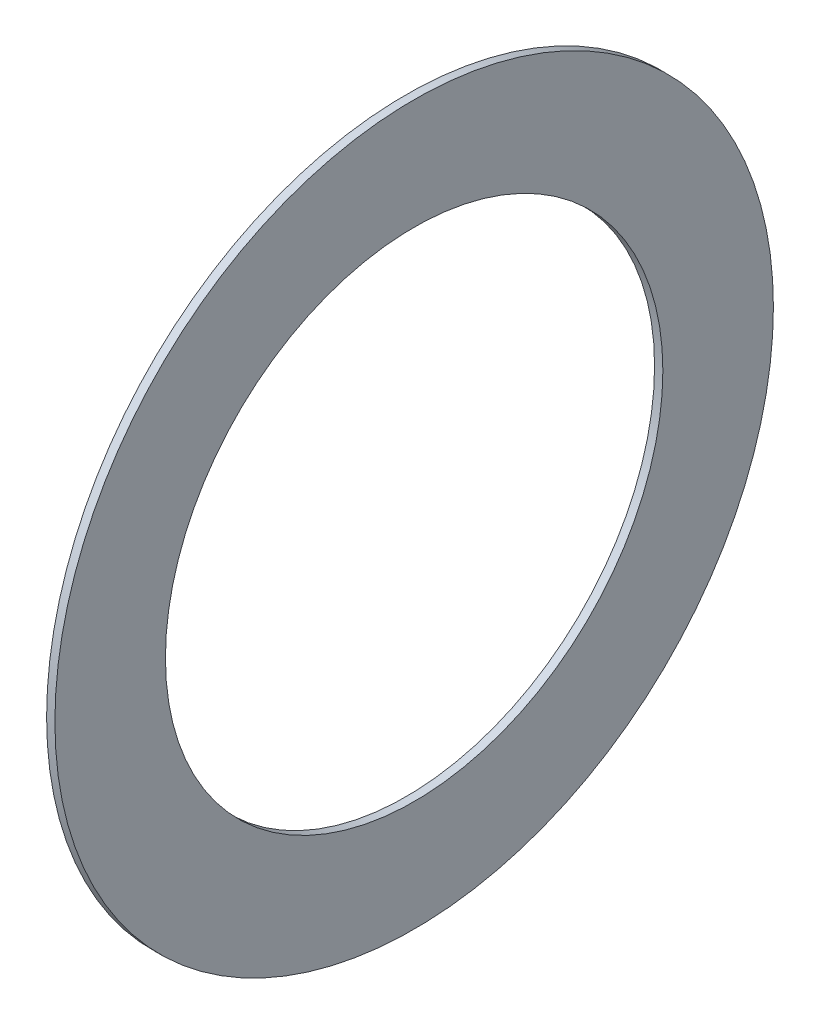
ISO-10303-21;
HEADER;
FILE_DESCRIPTION(('STEP AP214'),'2;1');
FILE_NAME('part.step','',(''),(''),'','','');
FILE_SCHEMA(('AUTOMOTIVE_DESIGN { 1 0 10303 214 1 1 1 1 }'));
ENDSEC;
DATA;
#1=APPLICATION_CONTEXT('core data for automotive mechanical design processes');
#2=APPLICATION_PROTOCOL_DEFINITION('international standard','automotive_design',2000,#1);
#3=PRODUCT_CONTEXT('',#1,'mechanical');
#4=PRODUCT('Part','Part','',(#3));
#5=PRODUCT_RELATED_PRODUCT_CATEGORY('part','',(#4));
#6=PRODUCT_DEFINITION_FORMATION('','',#4);
#7=PRODUCT_DEFINITION_CONTEXT('part definition',#1,'design');
#8=PRODUCT_DEFINITION('design','',#6,#7);
#9=PRODUCT_DEFINITION_SHAPE('','',#8);
#10=(LENGTH_UNIT() NAMED_UNIT(*) SI_UNIT(.MILLI.,.METRE.));
#11=(NAMED_UNIT(*) PLANE_ANGLE_UNIT() SI_UNIT($,.RADIAN.));
#12=(NAMED_UNIT(*) SI_UNIT($,.STERADIAN.) SOLID_ANGLE_UNIT());
#13=UNCERTAINTY_MEASURE_WITH_UNIT(LENGTH_MEASURE(1.E-05),#10,'distance_accuracy_value','');
#14=(GEOMETRIC_REPRESENTATION_CONTEXT(3) GLOBAL_UNCERTAINTY_ASSIGNED_CONTEXT((#13)) GLOBAL_UNIT_ASSIGNED_CONTEXT((#10,
#11,#12)) REPRESENTATION_CONTEXT('',''));
#15=CARTESIAN_POINT('',(0.,0.,0.));
#16=DIRECTION('',(0.,0.,1.));
#17=DIRECTION('',(1.,0.,0.));
#18=AXIS2_PLACEMENT_3D('',#15,#16,#17);
#19=CARTESIAN_POINT('',(0.4,0.,0.));
#20=DIRECTION('',(1.,0.,0.));
#21=DIRECTION('',(0.,0.,-1.));
#22=AXIS2_PLACEMENT_3D('',#19,#20,#21);
#23=CYLINDRICAL_SURFACE('',#22,6.5);
#24=CARTESIAN_POINT('',(0.25,0.,0.));
#25=DIRECTION('',(1.,0.,0.));
#26=DIRECTION('',(0.,0.,-1.));
#27=AXIS2_PLACEMENT_3D('',#24,#25,#26);
#28=CIRCLE('',#27,6.5);
#29=CARTESIAN_POINT('',(0.25,0.,-6.5));
#30=VERTEX_POINT('',#29);
#31=EDGE_CURVE('E30',#30,#30,#28,.T.);
#32=ORIENTED_EDGE('',*,*,#31,.T.);
#33=EDGE_LOOP('',(#32));
#34=FACE_BOUND('',#33,.T.);
#35=CARTESIAN_POINT('',(0.4,0.,0.));
#36=DIRECTION('',(1.,0.,0.));
#37=DIRECTION('',(0.,0.,-1.));
#38=AXIS2_PLACEMENT_3D('',#35,#36,#37);
#39=CIRCLE('',#38,6.5);
#40=CARTESIAN_POINT('',(0.4,0.,-6.5));
#41=VERTEX_POINT('',#40);
#42=EDGE_CURVE('E26',#41,#41,#39,.T.);
#43=ORIENTED_EDGE('',*,*,#42,.F.);
#44=EDGE_LOOP('',(#43));
#45=FACE_BOUND('',#44,.T.);
#46=ADVANCED_FACE('F15',(#34,#45),#23,.T.);
#47=CARTESIAN_POINT('',(0.25,6.5,0.));
#48=DIRECTION('',(-1.,0.,0.));
#49=DIRECTION('',(0.,0.,1.));
#50=AXIS2_PLACEMENT_3D('',#47,#48,#49);
#51=PLANE('',#50);
#52=CARTESIAN_POINT('',(0.25,0.,0.));
#53=DIRECTION('',(1.,0.,0.));
#54=DIRECTION('',(0.,0.,-1.));
#55=AXIS2_PLACEMENT_3D('',#52,#53,#54);
#56=CIRCLE('',#55,4.5);
#57=CARTESIAN_POINT('',(0.25,0.,-4.5));
#58=VERTEX_POINT('',#57);
#59=EDGE_CURVE('E22',#58,#58,#56,.T.);
#60=ORIENTED_EDGE('',*,*,#59,.T.);
#61=EDGE_LOOP('',(#60));
#62=FACE_BOUND('',#61,.T.);
#63=ORIENTED_EDGE('',*,*,#31,.F.);
#64=EDGE_LOOP('',(#63));
#65=FACE_BOUND('',#64,.T.);
#66=ADVANCED_FACE('F38',(#62,#65),#51,.T.);
#67=CARTESIAN_POINT('',(0.4,4.5,0.));
#68=DIRECTION('',(1.,0.,0.));
#69=DIRECTION('',(0.,0.,-1.));
#70=AXIS2_PLACEMENT_3D('',#67,#68,#69);
#71=PLANE('',#70);
#72=ORIENTED_EDGE('',*,*,#42,.T.);
#73=EDGE_LOOP('',(#72));
#74=FACE_BOUND('',#73,.T.);
#75=CARTESIAN_POINT('',(0.4,0.,0.));
#76=DIRECTION('',(1.,0.,0.));
#77=DIRECTION('',(0.,0.,-1.));
#78=AXIS2_PLACEMENT_3D('',#75,#76,#77);
#79=CIRCLE('',#78,4.5);
#80=CARTESIAN_POINT('',(0.4,0.,-4.5));
#81=VERTEX_POINT('',#80);
#82=EDGE_CURVE('E10',#81,#81,#79,.T.);
#83=ORIENTED_EDGE('',*,*,#82,.F.);
#84=EDGE_LOOP('',(#83));
#85=FACE_BOUND('',#84,.T.);
#86=ADVANCED_FACE('F40',(#74,#85),#71,.T.);
#87=CARTESIAN_POINT('',(0.4,0.,0.));
#88=DIRECTION('',(1.,0.,0.));
#89=DIRECTION('',(0.,0.,-1.));
#90=AXIS2_PLACEMENT_3D('',#87,#88,#89);
#91=CYLINDRICAL_SURFACE('',#90,4.5);
#92=ORIENTED_EDGE('',*,*,#82,.T.);
#93=EDGE_LOOP('',(#92));
#94=FACE_BOUND('',#93,.T.);
#95=ORIENTED_EDGE('',*,*,#59,.F.);
#96=EDGE_LOOP('',(#95));
#97=FACE_BOUND('',#96,.T.);
#98=ADVANCED_FACE('F17',(#94,#97),#91,.F.);
#99=CLOSED_SHELL('',(#46,#66,#86,#98));
#100=MANIFOLD_SOLID_BREP('B1',#99);
#101=ADVANCED_BREP_SHAPE_REPRESENTATION('',(#18,#100),#14);
#102=SHAPE_DEFINITION_REPRESENTATION(#9,#101);
ENDSEC;
END-ISO-10303-21;
